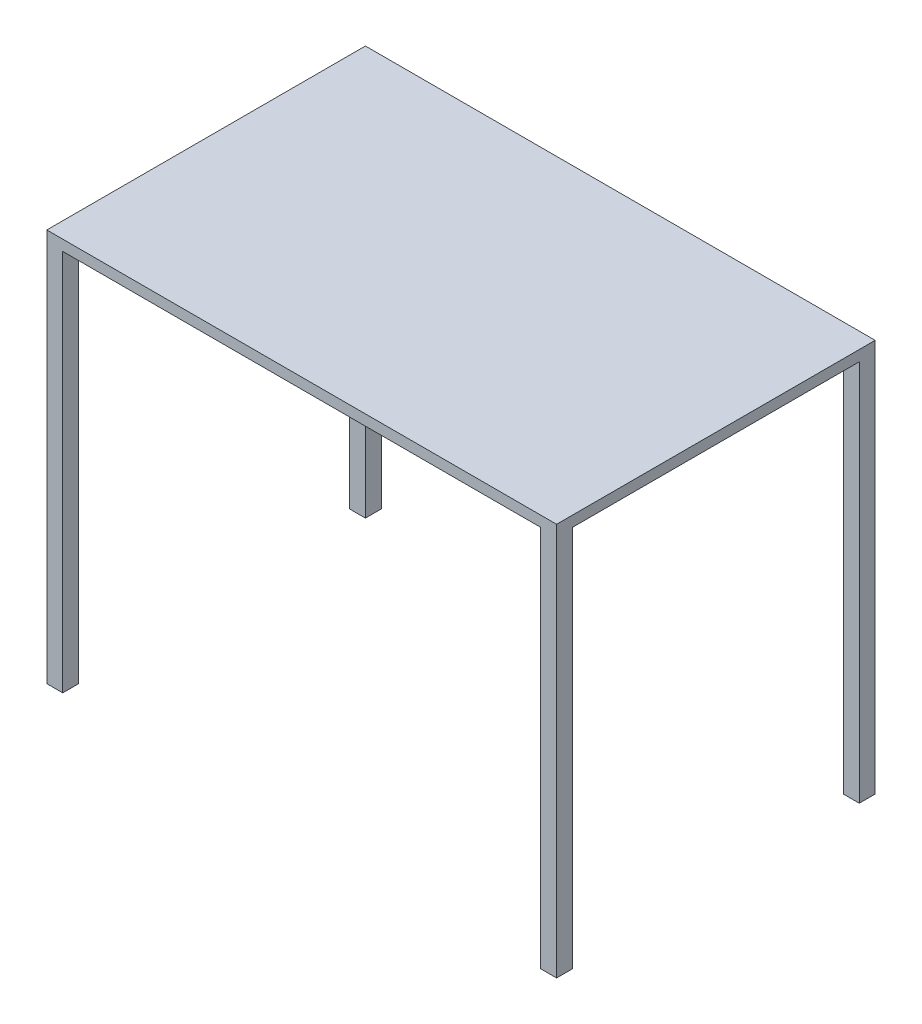
ISO-10303-21;
HEADER;
FILE_DESCRIPTION(('STEP AP214'),'2;1');
FILE_NAME('part.step','',(''),(''),'','','');
FILE_SCHEMA(('AUTOMOTIVE_DESIGN { 1 0 10303 214 1 1 1 1 }'));
ENDSEC;
DATA;
#1=APPLICATION_CONTEXT('core data for automotive mechanical design processes');
#2=APPLICATION_PROTOCOL_DEFINITION('international standard','automotive_design',2000,#1);
#3=PRODUCT_CONTEXT('',#1,'mechanical');
#4=PRODUCT('Part','Part','',(#3));
#5=PRODUCT_RELATED_PRODUCT_CATEGORY('part','',(#4));
#6=PRODUCT_DEFINITION_FORMATION('','',#4);
#7=PRODUCT_DEFINITION_CONTEXT('part definition',#1,'design');
#8=PRODUCT_DEFINITION('design','',#6,#7);
#9=PRODUCT_DEFINITION_SHAPE('','',#8);
#10=(LENGTH_UNIT() NAMED_UNIT(*) SI_UNIT(.MILLI.,.METRE.));
#11=(NAMED_UNIT(*) PLANE_ANGLE_UNIT() SI_UNIT($,.RADIAN.));
#12=(NAMED_UNIT(*) SI_UNIT($,.STERADIAN.) SOLID_ANGLE_UNIT());
#13=UNCERTAINTY_MEASURE_WITH_UNIT(LENGTH_MEASURE(1.E-05),#10,'distance_accuracy_value','');
#14=(GEOMETRIC_REPRESENTATION_CONTEXT(3) GLOBAL_UNCERTAINTY_ASSIGNED_CONTEXT((#13)) GLOBAL_UNIT_ASSIGNED_CONTEXT((#10,
#11,#12)) REPRESENTATION_CONTEXT('',''));
#15=CARTESIAN_POINT('',(0.,0.,0.));
#16=DIRECTION('',(0.,0.,1.));
#17=DIRECTION('',(1.,0.,0.));
#18=AXIS2_PLACEMENT_3D('',#15,#16,#17);
#19=CARTESIAN_POINT('',(0.,0.,0.));
#20=DIRECTION('',(0.,-1.,0.));
#21=DIRECTION('',(0.,0.,-1.));
#22=AXIS2_PLACEMENT_3D('',#19,#20,#21);
#23=PLANE('',#22);
#24=DIRECTION('',(-1.,0.,0.));
#25=VECTOR('',#24,1.);
#26=CARTESIAN_POINT('',(-609.6,0.,-342.9));
#27=LINE('',#26,#25);
#28=CARTESIAN_POINT('',(-571.5,0.,-342.9));
#29=VERTEX_POINT('',#28);
#30=CARTESIAN_POINT('',(-609.6,0.,-342.9));
#31=VERTEX_POINT('',#30);
#32=EDGE_CURVE('E167',#29,#31,#27,.T.);
#33=ORIENTED_EDGE('',*,*,#32,.F.);
#34=DIRECTION('',(0.,0.,1.));
#35=VECTOR('',#34,1.);
#36=CARTESIAN_POINT('',(-571.5,0.,-381.));
#37=LINE('',#36,#35);
#38=CARTESIAN_POINT('',(-571.5,0.,-381.));
#39=VERTEX_POINT('',#38);
#40=EDGE_CURVE('E301',#39,#29,#37,.T.);
#41=ORIENTED_EDGE('',*,*,#40,.F.);
#42=DIRECTION('',(-1.,0.,0.));
#43=VECTOR('',#42,1.);
#44=CARTESIAN_POINT('',(-609.6,0.,-381.));
#45=LINE('',#44,#43);
#46=CARTESIAN_POINT('',(571.5,0.,-381.));
#47=VERTEX_POINT('',#46);
#48=EDGE_CURVE('E171',#47,#39,#45,.T.);
#49=ORIENTED_EDGE('',*,*,#48,.F.);
#50=DIRECTION('',(0.,0.,-1.));
#51=VECTOR('',#50,1.);
#52=CARTESIAN_POINT('',(571.500000000001,0.,-380.999999999999));
#53=LINE('',#52,#51);
#54=CARTESIAN_POINT('',(571.500000000001,0.,-342.899999999999));
#55=VERTEX_POINT('',#54);
#56=EDGE_CURVE('E174',#55,#47,#53,.T.);
#57=ORIENTED_EDGE('',*,*,#56,.F.);
#58=DIRECTION('',(-1.,0.,0.));
#59=VECTOR('',#58,1.);
#60=CARTESIAN_POINT('',(609.600000000001,0.,-342.899999999999));
#61=LINE('',#60,#59);
#62=CARTESIAN_POINT('',(609.600000000001,0.,-342.899999999999));
#63=VERTEX_POINT('',#62);
#64=EDGE_CURVE('E172',#63,#55,#61,.T.);
#65=ORIENTED_EDGE('',*,*,#64,.F.);
#66=DIRECTION('',(0.,0.,-1.));
#67=VECTOR('',#66,1.);
#68=CARTESIAN_POINT('',(609.600000000001,0.,381.));
#69=LINE('',#68,#67);
#70=CARTESIAN_POINT('',(609.600000000001,0.,342.899999999999));
#71=VERTEX_POINT('',#70);
#72=EDGE_CURVE('E253',#71,#63,#69,.T.);
#73=ORIENTED_EDGE('',*,*,#72,.F.);
#74=DIRECTION('',(1.,0.,0.));
#75=VECTOR('',#74,1.);
#76=CARTESIAN_POINT('',(609.600000000001,0.,342.899999999999));
#77=LINE('',#76,#75);
#78=CARTESIAN_POINT('',(571.500000000001,0.,342.899999999999));
#79=VERTEX_POINT('',#78);
#80=EDGE_CURVE('E201',#79,#71,#77,.T.);
#81=ORIENTED_EDGE('',*,*,#80,.F.);
#82=DIRECTION('',(0.,0.,-1.));
#83=VECTOR('',#82,1.);
#84=CARTESIAN_POINT('',(571.500000000001,0.,380.999999999999));
#85=LINE('',#84,#83);
#86=CARTESIAN_POINT('',(571.500000000001,0.,380.999999999999));
#87=VERTEX_POINT('',#86);
#88=EDGE_CURVE('E196',#87,#79,#85,.T.);
#89=ORIENTED_EDGE('',*,*,#88,.F.);
#90=DIRECTION('',(1.,0.,0.));
#91=VECTOR('',#90,1.);
#92=CARTESIAN_POINT('',(-609.6,0.,381.));
#93=LINE('',#92,#91);
#94=CARTESIAN_POINT('',(-571.5,0.,381.));
#95=VERTEX_POINT('',#94);
#96=EDGE_CURVE('E263',#95,#87,#93,.T.);
#97=ORIENTED_EDGE('',*,*,#96,.F.);
#98=DIRECTION('',(0.,0.,1.));
#99=VECTOR('',#98,1.);
#100=CARTESIAN_POINT('',(-571.5,0.,381.));
#101=LINE('',#100,#99);
#102=CARTESIAN_POINT('',(-571.5,0.,342.9));
#103=VERTEX_POINT('',#102);
#104=EDGE_CURVE('E223',#103,#95,#101,.T.);
#105=ORIENTED_EDGE('',*,*,#104,.F.);
#106=DIRECTION('',(1.,0.,0.));
#107=VECTOR('',#106,1.);
#108=CARTESIAN_POINT('',(-609.6,0.,342.9));
#109=LINE('',#108,#107);
#110=CARTESIAN_POINT('',(-609.6,0.,342.9));
#111=VERTEX_POINT('',#110);
#112=EDGE_CURVE('E218',#111,#103,#109,.T.);
#113=ORIENTED_EDGE('',*,*,#112,.F.);
#114=DIRECTION('',(0.,0.,1.));
#115=VECTOR('',#114,1.);
#116=CARTESIAN_POINT('',(-609.6,0.,381.));
#117=LINE('',#116,#115);
#118=EDGE_CURVE('E36',#31,#111,#117,.T.);
#119=ORIENTED_EDGE('',*,*,#118,.F.);
#120=EDGE_LOOP('',(#33,#41,#49,#57,#65,#73,#81,#89,#97,#105,#113,#119));
#121=FACE_BOUND('',#120,.T.);
#122=ADVANCED_FACE('F32',(#121),#23,.T.);
#123=CARTESIAN_POINT('',(609.600000000001,25.4,381.));
#124=DIRECTION('',(-1.,0.,0.));
#125=DIRECTION('',(0.,0.,1.));
#126=AXIS2_PLACEMENT_3D('',#123,#124,#125);
#127=PLANE('',#126);
#128=DIRECTION('',(0.,-1.,0.));
#129=VECTOR('',#128,1.);
#130=CARTESIAN_POINT('',(609.600000000001,25.4,381.));
#131=LINE('',#130,#129);
#132=CARTESIAN_POINT('',(609.600000000001,25.4,381.));
#133=VERTEX_POINT('',#132);
#134=CARTESIAN_POINT('',(609.600000000001,-914.4,380.999999999999));
#135=VERTEX_POINT('',#134);
#136=EDGE_CURVE('E271',#133,#135,#131,.T.);
#137=ORIENTED_EDGE('',*,*,#136,.T.);
#138=DIRECTION('',(0.,0.,1.));
#139=VECTOR('',#138,1.);
#140=CARTESIAN_POINT('',(609.600000000001,-914.4,380.999999999999));
#141=LINE('',#140,#139);
#142=CARTESIAN_POINT('',(609.600000000001,-914.4,342.899999999999));
#143=VERTEX_POINT('',#142);
#144=EDGE_CURVE('E205',#143,#135,#141,.T.);
#145=ORIENTED_EDGE('',*,*,#144,.F.);
#146=DIRECTION('',(0.,1.,0.));
#147=VECTOR('',#146,1.);
#148=CARTESIAN_POINT('',(609.600000000001,-914.4,342.899999999999));
#149=LINE('',#148,#147);
#150=EDGE_CURVE('E208',#143,#71,#149,.T.);
#151=ORIENTED_EDGE('',*,*,#150,.T.);
#152=ORIENTED_EDGE('',*,*,#72,.T.);
#153=DIRECTION('',(0.,1.,0.));
#154=VECTOR('',#153,1.);
#155=CARTESIAN_POINT('',(609.600000000001,-914.4,-342.899999999999));
#156=LINE('',#155,#154);
#157=CARTESIAN_POINT('',(609.600000000001,-914.4,-342.899999999999));
#158=VERTEX_POINT('',#157);
#159=EDGE_CURVE('E194',#158,#63,#156,.T.);
#160=ORIENTED_EDGE('',*,*,#159,.F.);
#161=DIRECTION('',(0.,0.,1.));
#162=VECTOR('',#161,1.);
#163=CARTESIAN_POINT('',(609.600000000001,-914.4,-380.999999999999));
#164=LINE('',#163,#162);
#165=CARTESIAN_POINT('',(609.600000000001,-914.4,-380.999999999999));
#166=VERTEX_POINT('',#165);
#167=EDGE_CURVE('E179',#166,#158,#164,.T.);
#168=ORIENTED_EDGE('',*,*,#167,.F.);
#169=DIRECTION('',(0.,-1.,0.));
#170=VECTOR('',#169,1.);
#171=CARTESIAN_POINT('',(609.600000000001,25.4,-381.));
#172=LINE('',#171,#170);
#173=CARTESIAN_POINT('',(609.600000000001,25.4,-381.));
#174=VERTEX_POINT('',#173);
#175=EDGE_CURVE('E11',#174,#166,#172,.T.);
#176=ORIENTED_EDGE('',*,*,#175,.F.);
#177=DIRECTION('',(0.,0.,-1.));
#178=VECTOR('',#177,1.);
#179=CARTESIAN_POINT('',(609.600000000001,25.4,381.));
#180=LINE('',#179,#178);
#181=EDGE_CURVE('E265',#133,#174,#180,.T.);
#182=ORIENTED_EDGE('',*,*,#181,.F.);
#183=EDGE_LOOP('',(#137,#145,#151,#152,#160,#168,#176,#182));
#184=FACE_BOUND('',#183,.T.);
#185=ADVANCED_FACE('F34',(#184),#127,.F.);
#186=CARTESIAN_POINT('',(-609.6,25.4,-381.));
#187=DIRECTION('',(0.,0.,1.));
#188=DIRECTION('',(1.,0.,0.));
#189=AXIS2_PLACEMENT_3D('',#186,#187,#188);
#190=PLANE('',#189);
#191=ORIENTED_EDGE('',*,*,#175,.T.);
#192=DIRECTION('',(1.,0.,0.));
#193=VECTOR('',#192,1.);
#194=CARTESIAN_POINT('',(609.600000000001,-914.4,-380.999999999999));
#195=LINE('',#194,#193);
#196=CARTESIAN_POINT('',(571.500000000001,-914.4,-380.999999999999));
#197=VERTEX_POINT('',#196);
#198=EDGE_CURVE('E186',#197,#166,#195,.T.);
#199=ORIENTED_EDGE('',*,*,#198,.F.);
#200=DIRECTION('',(0.,1.,0.));
#201=VECTOR('',#200,1.);
#202=CARTESIAN_POINT('',(571.500000000001,-914.4,-380.999999999999));
#203=LINE('',#202,#201);
#204=EDGE_CURVE('E58',#197,#47,#203,.T.);
#205=ORIENTED_EDGE('',*,*,#204,.T.);
#206=ORIENTED_EDGE('',*,*,#48,.T.);
#207=DIRECTION('',(0.,1.,0.));
#208=VECTOR('',#207,1.);
#209=CARTESIAN_POINT('',(-571.5,-914.4,-381.));
#210=LINE('',#209,#208);
#211=CARTESIAN_POINT('',(-571.5,-914.4,-381.));
#212=VERTEX_POINT('',#211);
#213=EDGE_CURVE('E153',#212,#39,#210,.T.);
#214=ORIENTED_EDGE('',*,*,#213,.F.);
#215=DIRECTION('',(1.,0.,0.));
#216=VECTOR('',#215,1.);
#217=CARTESIAN_POINT('',(-609.6,-914.4,-381.));
#218=LINE('',#217,#216);
#219=CARTESIAN_POINT('',(-609.6,-914.4,-381.));
#220=VERTEX_POINT('',#219);
#221=EDGE_CURVE('E160',#220,#212,#218,.T.);
#222=ORIENTED_EDGE('',*,*,#221,.F.);
#223=DIRECTION('',(0.,-1.,0.));
#224=VECTOR('',#223,1.);
#225=CARTESIAN_POINT('',(-609.6,25.4,-381.));
#226=LINE('',#225,#224);
#227=CARTESIAN_POINT('',(-609.6,25.4,-381.));
#228=VERTEX_POINT('',#227);
#229=EDGE_CURVE('E42',#228,#220,#226,.T.);
#230=ORIENTED_EDGE('',*,*,#229,.F.);
#231=DIRECTION('',(-1.,0.,0.));
#232=VECTOR('',#231,1.);
#233=CARTESIAN_POINT('',(-609.6,25.4,-381.));
#234=LINE('',#233,#232);
#235=EDGE_CURVE('E279',#174,#228,#234,.T.);
#236=ORIENTED_EDGE('',*,*,#235,.F.);
#237=EDGE_LOOP('',(#191,#199,#205,#206,#214,#222,#230,#236));
#238=FACE_BOUND('',#237,.T.);
#239=ADVANCED_FACE('F169',(#238),#190,.F.);
#240=CARTESIAN_POINT('',(-609.6,25.4,381.));
#241=DIRECTION('',(1.,0.,0.));
#242=DIRECTION('',(0.,0.,-1.));
#243=AXIS2_PLACEMENT_3D('',#240,#241,#242);
#244=PLANE('',#243);
#245=ORIENTED_EDGE('',*,*,#229,.T.);
#246=DIRECTION('',(0.,0.,-1.));
#247=VECTOR('',#246,1.);
#248=CARTESIAN_POINT('',(-609.6,-914.4,-381.));
#249=LINE('',#248,#247);
#250=CARTESIAN_POINT('',(-609.6,-914.4,-342.9));
#251=VERTEX_POINT('',#250);
#252=EDGE_CURVE('E165',#251,#220,#249,.T.);
#253=ORIENTED_EDGE('',*,*,#252,.F.);
#254=DIRECTION('',(0.,1.,0.));
#255=VECTOR('',#254,1.);
#256=CARTESIAN_POINT('',(-609.6,-914.4,-342.9));
#257=LINE('',#256,#255);
#258=EDGE_CURVE('E50',#251,#31,#257,.T.);
#259=ORIENTED_EDGE('',*,*,#258,.T.);
#260=ORIENTED_EDGE('',*,*,#118,.T.);
#261=DIRECTION('',(0.,1.,0.));
#262=VECTOR('',#261,1.);
#263=CARTESIAN_POINT('',(-609.6,-914.4,342.9));
#264=LINE('',#263,#262);
#265=CARTESIAN_POINT('',(-609.6,-914.4,342.9));
#266=VERTEX_POINT('',#265);
#267=EDGE_CURVE('E248',#266,#111,#264,.T.);
#268=ORIENTED_EDGE('',*,*,#267,.F.);
#269=DIRECTION('',(0.,0.,-1.));
#270=VECTOR('',#269,1.);
#271=CARTESIAN_POINT('',(-609.6,-914.4,381.));
#272=LINE('',#271,#270);
#273=CARTESIAN_POINT('',(-609.6,-914.4,381.));
#274=VERTEX_POINT('',#273);
#275=EDGE_CURVE('E219',#274,#266,#272,.T.);
#276=ORIENTED_EDGE('',*,*,#275,.F.);
#277=DIRECTION('',(0.,-1.,0.));
#278=VECTOR('',#277,1.);
#279=CARTESIAN_POINT('',(-609.6,25.4,381.));
#280=LINE('',#279,#278);
#281=CARTESIAN_POINT('',(-609.6,25.4,381.));
#282=VERTEX_POINT('',#281);
#283=EDGE_CURVE('E273',#282,#274,#280,.T.);
#284=ORIENTED_EDGE('',*,*,#283,.F.);
#285=DIRECTION('',(0.,0.,1.));
#286=VECTOR('',#285,1.);
#287=CARTESIAN_POINT('',(-609.6,25.4,381.));
#288=LINE('',#287,#286);
#289=EDGE_CURVE('E278',#228,#282,#288,.T.);
#290=ORIENTED_EDGE('',*,*,#289,.F.);
#291=EDGE_LOOP('',(#245,#253,#259,#260,#268,#276,#284,#290));
#292=FACE_BOUND('',#291,.T.);
#293=ADVANCED_FACE('F276',(#292),#244,.F.);
#294=CARTESIAN_POINT('',(-609.6,25.4,381.));
#295=DIRECTION('',(0.,0.,-1.));
#296=DIRECTION('',(-1.,0.,0.));
#297=AXIS2_PLACEMENT_3D('',#294,#295,#296);
#298=PLANE('',#297);
#299=ORIENTED_EDGE('',*,*,#283,.T.);
#300=DIRECTION('',(-1.,0.,0.));
#301=VECTOR('',#300,1.);
#302=CARTESIAN_POINT('',(-609.6,-914.4,381.));
#303=LINE('',#302,#301);
#304=CARTESIAN_POINT('',(-571.5,-914.4,381.));
#305=VERTEX_POINT('',#304);
#306=EDGE_CURVE('E227',#305,#274,#303,.T.);
#307=ORIENTED_EDGE('',*,*,#306,.F.);
#308=DIRECTION('',(0.,1.,0.));
#309=VECTOR('',#308,1.);
#310=CARTESIAN_POINT('',(-571.5,-914.4,381.));
#311=LINE('',#310,#309);
#312=EDGE_CURVE('E230',#305,#95,#311,.T.);
#313=ORIENTED_EDGE('',*,*,#312,.T.);
#314=ORIENTED_EDGE('',*,*,#96,.T.);
#315=DIRECTION('',(0.,1.,0.));
#316=VECTOR('',#315,1.);
#317=CARTESIAN_POINT('',(571.500000000001,-914.4,380.999999999999));
#318=LINE('',#317,#316);
#319=CARTESIAN_POINT('',(571.500000000001,-914.4,380.999999999999));
#320=VERTEX_POINT('',#319);
#321=EDGE_CURVE('E216',#320,#87,#318,.T.);
#322=ORIENTED_EDGE('',*,*,#321,.F.);
#323=DIRECTION('',(-1.,0.,0.));
#324=VECTOR('',#323,1.);
#325=CARTESIAN_POINT('',(609.600000000001,-914.4,380.999999999999));
#326=LINE('',#325,#324);
#327=EDGE_CURVE('E197',#135,#320,#326,.T.);
#328=ORIENTED_EDGE('',*,*,#327,.F.);
#329=ORIENTED_EDGE('',*,*,#136,.F.);
#330=DIRECTION('',(1.,0.,0.));
#331=VECTOR('',#330,1.);
#332=CARTESIAN_POINT('',(-609.6,25.4,381.));
#333=LINE('',#332,#331);
#334=EDGE_CURVE('E274',#282,#133,#333,.T.);
#335=ORIENTED_EDGE('',*,*,#334,.F.);
#336=EDGE_LOOP('',(#299,#307,#313,#314,#322,#328,#329,#335));
#337=FACE_BOUND('',#336,.T.);
#338=ADVANCED_FACE('F305',(#337),#298,.F.);
#339=CARTESIAN_POINT('',(0.,25.4,0.));
#340=DIRECTION('',(0.,-1.,0.));
#341=DIRECTION('',(0.,0.,-1.));
#342=AXIS2_PLACEMENT_3D('',#339,#340,#341);
#343=PLANE('',#342);
#344=ORIENTED_EDGE('',*,*,#181,.T.);
#345=ORIENTED_EDGE('',*,*,#235,.T.);
#346=ORIENTED_EDGE('',*,*,#289,.T.);
#347=ORIENTED_EDGE('',*,*,#334,.T.);
#348=EDGE_LOOP('',(#344,#345,#346,#347));
#349=FACE_BOUND('',#348,.T.);
#350=ADVANCED_FACE('F285',(#349),#343,.F.);
#351=CARTESIAN_POINT('',(-609.6,-914.4,342.9));
#352=DIRECTION('',(0.,0.,1.));
#353=DIRECTION('',(1.,0.,0.));
#354=AXIS2_PLACEMENT_3D('',#351,#352,#353);
#355=PLANE('',#354);
#356=ORIENTED_EDGE('',*,*,#112,.T.);
#357=DIRECTION('',(0.,1.,0.));
#358=VECTOR('',#357,1.);
#359=CARTESIAN_POINT('',(-571.5,-914.4,342.9));
#360=LINE('',#359,#358);
#361=CARTESIAN_POINT('',(-571.5,-914.4,342.9));
#362=VERTEX_POINT('',#361);
#363=EDGE_CURVE('E233',#362,#103,#360,.T.);
#364=ORIENTED_EDGE('',*,*,#363,.F.);
#365=DIRECTION('',(1.,0.,0.));
#366=VECTOR('',#365,1.);
#367=CARTESIAN_POINT('',(-609.6,-914.4,342.9));
#368=LINE('',#367,#366);
#369=EDGE_CURVE('E222',#266,#362,#368,.T.);
#370=ORIENTED_EDGE('',*,*,#369,.F.);
#371=ORIENTED_EDGE('',*,*,#267,.T.);
#372=EDGE_LOOP('',(#356,#364,#370,#371));
#373=FACE_BOUND('',#372,.T.);
#374=ADVANCED_FACE('F360',(#373),#355,.F.);
#375=CARTESIAN_POINT('',(-571.5,-914.4,381.));
#376=DIRECTION('',(-1.,0.,0.));
#377=DIRECTION('',(0.,0.,1.));
#378=AXIS2_PLACEMENT_3D('',#375,#376,#377);
#379=PLANE('',#378);
#380=ORIENTED_EDGE('',*,*,#104,.T.);
#381=ORIENTED_EDGE('',*,*,#312,.F.);
#382=DIRECTION('',(0.,0.,1.));
#383=VECTOR('',#382,1.);
#384=CARTESIAN_POINT('',(-571.5,-914.4,381.));
#385=LINE('',#384,#383);
#386=EDGE_CURVE('E225',#362,#305,#385,.T.);
#387=ORIENTED_EDGE('',*,*,#386,.F.);
#388=ORIENTED_EDGE('',*,*,#363,.T.);
#389=EDGE_LOOP('',(#380,#381,#387,#388));
#390=FACE_BOUND('',#389,.T.);
#391=ADVANCED_FACE('F365',(#390),#379,.F.);
#392=CARTESIAN_POINT('',(0.,-914.4,0.));
#393=DIRECTION('',(0.,-1.,0.));
#394=DIRECTION('',(0.,0.,-1.));
#395=AXIS2_PLACEMENT_3D('',#392,#393,#394);
#396=PLANE('',#395);
#397=ORIENTED_EDGE('',*,*,#275,.T.);
#398=ORIENTED_EDGE('',*,*,#369,.T.);
#399=ORIENTED_EDGE('',*,*,#386,.T.);
#400=ORIENTED_EDGE('',*,*,#306,.T.);
#401=EDGE_LOOP('',(#397,#398,#399,#400));
#402=FACE_BOUND('',#401,.T.);
#403=ADVANCED_FACE('F371',(#402),#396,.T.);
#404=CARTESIAN_POINT('',(571.500000000001,-914.4,380.999999999999));
#405=DIRECTION('',(1.,0.,0.));
#406=DIRECTION('',(0.,0.,-1.));
#407=AXIS2_PLACEMENT_3D('',#404,#405,#406);
#408=PLANE('',#407);
#409=ORIENTED_EDGE('',*,*,#88,.T.);
#410=DIRECTION('',(0.,1.,0.));
#411=VECTOR('',#410,1.);
#412=CARTESIAN_POINT('',(571.500000000001,-914.4,342.899999999999));
#413=LINE('',#412,#411);
#414=CARTESIAN_POINT('',(571.500000000001,-914.4,342.899999999999));
#415=VERTEX_POINT('',#414);
#416=EDGE_CURVE('E213',#415,#79,#413,.T.);
#417=ORIENTED_EDGE('',*,*,#416,.F.);
#418=DIRECTION('',(0.,0.,-1.));
#419=VECTOR('',#418,1.);
#420=CARTESIAN_POINT('',(571.500000000001,-914.4,380.999999999999));
#421=LINE('',#420,#419);
#422=EDGE_CURVE('E200',#320,#415,#421,.T.);
#423=ORIENTED_EDGE('',*,*,#422,.F.);
#424=ORIENTED_EDGE('',*,*,#321,.T.);
#425=EDGE_LOOP('',(#409,#417,#423,#424));
#426=FACE_BOUND('',#425,.T.);
#427=ADVANCED_FACE('F378',(#426),#408,.F.);
#428=CARTESIAN_POINT('',(609.600000000001,-914.4,342.899999999999));
#429=DIRECTION('',(0.,0.,1.));
#430=DIRECTION('',(1.,0.,0.));
#431=AXIS2_PLACEMENT_3D('',#428,#429,#430);
#432=PLANE('',#431);
#433=ORIENTED_EDGE('',*,*,#80,.T.);
#434=ORIENTED_EDGE('',*,*,#150,.F.);
#435=DIRECTION('',(1.,0.,0.));
#436=VECTOR('',#435,1.);
#437=CARTESIAN_POINT('',(609.600000000001,-914.4,342.899999999999));
#438=LINE('',#437,#436);
#439=EDGE_CURVE('E203',#415,#143,#438,.T.);
#440=ORIENTED_EDGE('',*,*,#439,.F.);
#441=ORIENTED_EDGE('',*,*,#416,.T.);
#442=EDGE_LOOP('',(#433,#434,#440,#441));
#443=FACE_BOUND('',#442,.T.);
#444=ADVANCED_FACE('F315',(#443),#432,.F.);
#445=CARTESIAN_POINT('',(0.,-914.4,0.));
#446=DIRECTION('',(0.,-1.,0.));
#447=DIRECTION('',(0.,0.,-1.));
#448=AXIS2_PLACEMENT_3D('',#445,#446,#447);
#449=PLANE('',#448);
#450=ORIENTED_EDGE('',*,*,#327,.T.);
#451=ORIENTED_EDGE('',*,*,#422,.T.);
#452=ORIENTED_EDGE('',*,*,#439,.T.);
#453=ORIENTED_EDGE('',*,*,#144,.T.);
#454=EDGE_LOOP('',(#450,#451,#452,#453));
#455=FACE_BOUND('',#454,.T.);
#456=ADVANCED_FACE('F310',(#455),#449,.T.);
#457=CARTESIAN_POINT('',(609.600000000001,-914.4,-342.899999999999));
#458=DIRECTION('',(0.,0.,-1.));
#459=DIRECTION('',(-1.,0.,0.));
#460=AXIS2_PLACEMENT_3D('',#457,#458,#459);
#461=PLANE('',#460);
#462=ORIENTED_EDGE('',*,*,#64,.T.);
#463=DIRECTION('',(0.,1.,0.));
#464=VECTOR('',#463,1.);
#465=CARTESIAN_POINT('',(571.500000000001,-914.4,-342.899999999999));
#466=LINE('',#465,#464);
#467=CARTESIAN_POINT('',(571.500000000001,-914.4,-342.899999999999));
#468=VERTEX_POINT('',#467);
#469=EDGE_CURVE('E191',#468,#55,#466,.T.);
#470=ORIENTED_EDGE('',*,*,#469,.F.);
#471=DIRECTION('',(-1.,0.,0.));
#472=VECTOR('',#471,1.);
#473=CARTESIAN_POINT('',(609.600000000001,-914.4,-342.899999999999));
#474=LINE('',#473,#472);
#475=EDGE_CURVE('E182',#158,#468,#474,.T.);
#476=ORIENTED_EDGE('',*,*,#475,.F.);
#477=ORIENTED_EDGE('',*,*,#159,.T.);
#478=EDGE_LOOP('',(#462,#470,#476,#477));
#479=FACE_BOUND('',#478,.T.);
#480=ADVANCED_FACE('F320',(#479),#461,.F.);
#481=CARTESIAN_POINT('',(571.500000000001,-914.4,-380.999999999999));
#482=DIRECTION('',(1.,0.,0.));
#483=DIRECTION('',(0.,0.,-1.));
#484=AXIS2_PLACEMENT_3D('',#481,#482,#483);
#485=PLANE('',#484);
#486=ORIENTED_EDGE('',*,*,#56,.T.);
#487=ORIENTED_EDGE('',*,*,#204,.F.);
#488=DIRECTION('',(0.,0.,-1.));
#489=VECTOR('',#488,1.);
#490=CARTESIAN_POINT('',(571.500000000001,-914.4,-380.999999999999));
#491=LINE('',#490,#489);
#492=EDGE_CURVE('E184',#468,#197,#491,.T.);
#493=ORIENTED_EDGE('',*,*,#492,.F.);
#494=ORIENTED_EDGE('',*,*,#469,.T.);
#495=EDGE_LOOP('',(#486,#487,#493,#494));
#496=FACE_BOUND('',#495,.T.);
#497=ADVANCED_FACE('F296',(#496),#485,.F.);
#498=CARTESIAN_POINT('',(0.,-914.4,0.));
#499=DIRECTION('',(0.,-1.,0.));
#500=DIRECTION('',(0.,0.,-1.));
#501=AXIS2_PLACEMENT_3D('',#498,#499,#500);
#502=PLANE('',#501);
#503=ORIENTED_EDGE('',*,*,#167,.T.);
#504=ORIENTED_EDGE('',*,*,#475,.T.);
#505=ORIENTED_EDGE('',*,*,#492,.T.);
#506=ORIENTED_EDGE('',*,*,#198,.T.);
#507=EDGE_LOOP('',(#503,#504,#505,#506));
#508=FACE_BOUND('',#507,.T.);
#509=ADVANCED_FACE('F292',(#508),#502,.T.);
#510=CARTESIAN_POINT('',(-571.5,-914.4,-381.));
#511=DIRECTION('',(-1.,0.,0.));
#512=DIRECTION('',(0.,0.,1.));
#513=AXIS2_PLACEMENT_3D('',#510,#511,#512);
#514=PLANE('',#513);
#515=ORIENTED_EDGE('',*,*,#40,.T.);
#516=DIRECTION('',(0.,1.,0.));
#517=VECTOR('',#516,1.);
#518=CARTESIAN_POINT('',(-571.5,-914.4,-342.9));
#519=LINE('',#518,#517);
#520=CARTESIAN_POINT('',(-571.5,-914.4,-342.9));
#521=VERTEX_POINT('',#520);
#522=EDGE_CURVE('E156',#521,#29,#519,.T.);
#523=ORIENTED_EDGE('',*,*,#522,.F.);
#524=DIRECTION('',(0.,0.,1.));
#525=VECTOR('',#524,1.);
#526=CARTESIAN_POINT('',(-571.5,-914.4,-381.));
#527=LINE('',#526,#525);
#528=EDGE_CURVE('E149',#212,#521,#527,.T.);
#529=ORIENTED_EDGE('',*,*,#528,.F.);
#530=ORIENTED_EDGE('',*,*,#213,.T.);
#531=EDGE_LOOP('',(#515,#523,#529,#530));
#532=FACE_BOUND('',#531,.T.);
#533=ADVANCED_FACE('F151',(#532),#514,.F.);
#534=CARTESIAN_POINT('',(-609.6,-914.4,-342.9));
#535=DIRECTION('',(0.,0.,-1.));
#536=DIRECTION('',(-1.,0.,0.));
#537=AXIS2_PLACEMENT_3D('',#534,#535,#536);
#538=PLANE('',#537);
#539=ORIENTED_EDGE('',*,*,#32,.T.);
#540=ORIENTED_EDGE('',*,*,#258,.F.);
#541=DIRECTION('',(-1.,0.,0.));
#542=VECTOR('',#541,1.);
#543=CARTESIAN_POINT('',(-609.6,-914.4,-342.9));
#544=LINE('',#543,#542);
#545=EDGE_CURVE('E159',#521,#251,#544,.T.);
#546=ORIENTED_EDGE('',*,*,#545,.F.);
#547=ORIENTED_EDGE('',*,*,#522,.T.);
#548=EDGE_LOOP('',(#539,#540,#546,#547));
#549=FACE_BOUND('',#548,.T.);
#550=ADVANCED_FACE('F424',(#549),#538,.F.);
#551=CARTESIAN_POINT('',(0.,-914.4,0.));
#552=DIRECTION('',(0.,-1.,0.));
#553=DIRECTION('',(0.,0.,-1.));
#554=AXIS2_PLACEMENT_3D('',#551,#552,#553);
#555=PLANE('',#554);
#556=ORIENTED_EDGE('',*,*,#221,.T.);
#557=ORIENTED_EDGE('',*,*,#528,.T.);
#558=ORIENTED_EDGE('',*,*,#545,.T.);
#559=ORIENTED_EDGE('',*,*,#252,.T.);
#560=EDGE_LOOP('',(#556,#557,#558,#559));
#561=FACE_BOUND('',#560,.T.);
#562=ADVANCED_FACE('F164',(#561),#555,.T.);
#563=CLOSED_SHELL('',(#122,#185,#239,#293,#338,#350,#374,#391,#403,#427,#444,#456,#480,#497,
#509,#533,#550,#562));
#564=MANIFOLD_SOLID_BREP('B2',#563);
#565=ADVANCED_BREP_SHAPE_REPRESENTATION('',(#18,#564),#14);
#566=SHAPE_DEFINITION_REPRESENTATION(#9,#565);
ENDSEC;
END-ISO-10303-21;
